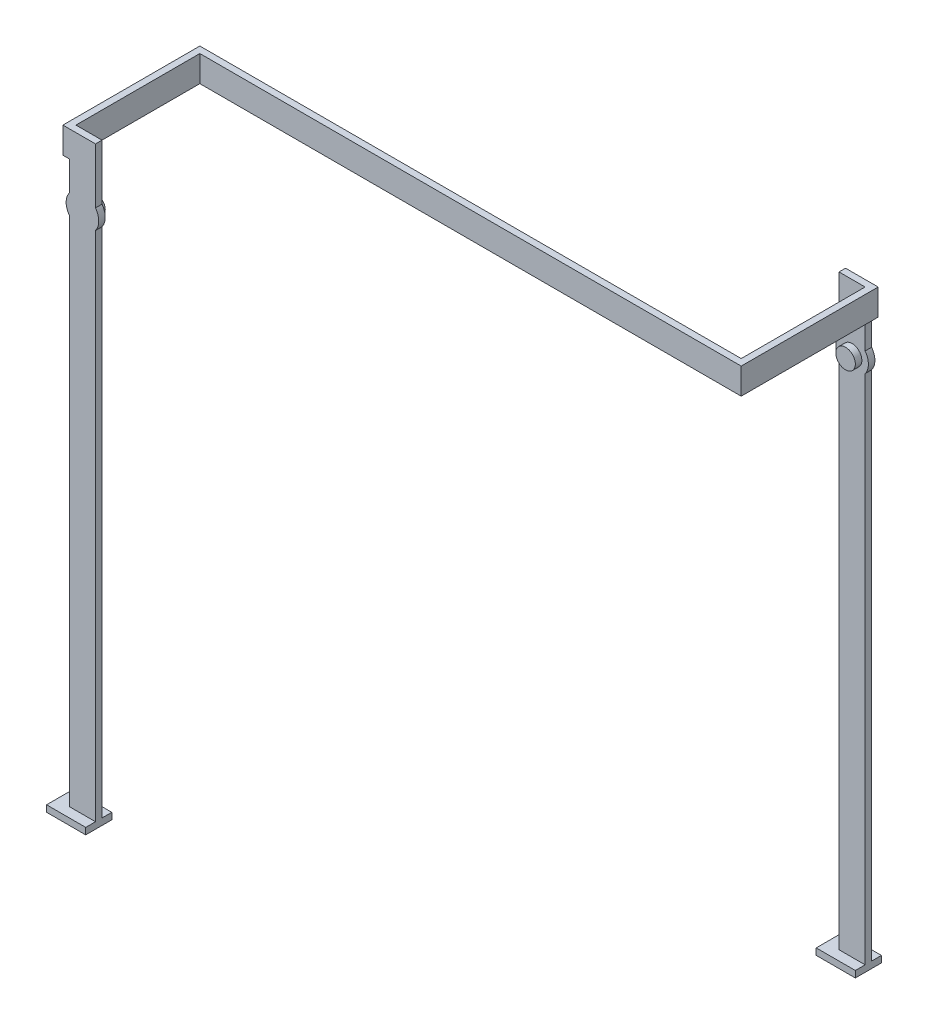
ISO-10303-21;
HEADER;
FILE_DESCRIPTION(('STEP AP214'),'2;1');
FILE_NAME('part.step','',(''),(''),'','','');
FILE_SCHEMA(('AUTOMOTIVE_DESIGN { 1 0 10303 214 1 1 1 1 }'));
ENDSEC;
DATA;
#1=APPLICATION_CONTEXT('core data for automotive mechanical design processes');
#2=APPLICATION_PROTOCOL_DEFINITION('international standard','automotive_design',2000,#1);
#3=PRODUCT_CONTEXT('',#1,'mechanical');
#4=PRODUCT('Part','Part','',(#3));
#5=PRODUCT_RELATED_PRODUCT_CATEGORY('part','',(#4));
#6=PRODUCT_DEFINITION_FORMATION('','',#4);
#7=PRODUCT_DEFINITION_CONTEXT('part definition',#1,'design');
#8=PRODUCT_DEFINITION('design','',#6,#7);
#9=PRODUCT_DEFINITION_SHAPE('','',#8);
#10=(LENGTH_UNIT() NAMED_UNIT(*) SI_UNIT(.MILLI.,.METRE.));
#11=(NAMED_UNIT(*) PLANE_ANGLE_UNIT() SI_UNIT($,.RADIAN.));
#12=(NAMED_UNIT(*) SI_UNIT($,.STERADIAN.) SOLID_ANGLE_UNIT());
#13=UNCERTAINTY_MEASURE_WITH_UNIT(LENGTH_MEASURE(1.E-05),#10,'distance_accuracy_value','');
#14=(GEOMETRIC_REPRESENTATION_CONTEXT(3) GLOBAL_UNCERTAINTY_ASSIGNED_CONTEXT((#13)) GLOBAL_UNIT_ASSIGNED_CONTEXT((#10,
#11,#12)) REPRESENTATION_CONTEXT('',''));
#15=CARTESIAN_POINT('',(0.,0.,0.));
#16=DIRECTION('',(0.,0.,1.));
#17=DIRECTION('',(1.,0.,0.));
#18=AXIS2_PLACEMENT_3D('',#15,#16,#17);
#19=CARTESIAN_POINT('',(25.7222833277684,47.5928129760568,-20.5));
#20=DIRECTION('',(-1.,0.,0.));
#21=DIRECTION('',(0.,0.,1.));
#22=AXIS2_PLACEMENT_3D('',#19,#20,#21);
#23=PLANE('',#22);
#24=DIRECTION('',(0.,0.,-1.));
#25=VECTOR('',#24,1.);
#26=CARTESIAN_POINT('',(25.7222833277684,47.5928129760568,-20.5));
#27=LINE('',#26,#25);
#28=CARTESIAN_POINT('',(25.7222833277684,47.5928129760568,-0.499999999999997));
#29=VERTEX_POINT('',#28);
#30=CARTESIAN_POINT('',(25.7222833277684,47.5928129760568,-19.5));
#31=VERTEX_POINT('',#30);
#32=EDGE_CURVE('E414',#29,#31,#27,.T.);
#33=ORIENTED_EDGE('',*,*,#32,.F.);
#34=DIRECTION('',(0.,1.,0.));
#35=VECTOR('',#34,1.);
#36=CARTESIAN_POINT('',(25.7222833277684,51.5928129760568,-0.5));
#37=LINE('',#36,#35);
#38=CARTESIAN_POINT('',(25.7222833277684,51.5928129760568,-0.5));
#39=VERTEX_POINT('',#38);
#40=EDGE_CURVE('E49',#29,#39,#37,.T.);
#41=ORIENTED_EDGE('',*,*,#40,.T.);
#42=DIRECTION('',(0.,0.,1.));
#43=VECTOR('',#42,1.);
#44=CARTESIAN_POINT('',(25.7222833277684,51.5928129760578,-20.5));
#45=LINE('',#44,#43);
#46=CARTESIAN_POINT('',(25.7222833277684,51.5928129760578,-19.5));
#47=VERTEX_POINT('',#46);
#48=EDGE_CURVE('E409',#47,#39,#45,.T.);
#49=ORIENTED_EDGE('',*,*,#48,.F.);
#50=DIRECTION('',(0.,-1.,0.));
#51=VECTOR('',#50,1.);
#52=CARTESIAN_POINT('',(25.7222833277684,51.5928129760579,-19.5));
#53=LINE('',#52,#51);
#54=EDGE_CURVE('E327',#47,#31,#53,.T.);
#55=ORIENTED_EDGE('',*,*,#54,.T.);
#56=EDGE_LOOP('',(#33,#41,#49,#55));
#57=FACE_BOUND('',#56,.T.);
#58=ADVANCED_FACE('F31',(#57),#23,.T.);
#59=CARTESIAN_POINT('',(25.7222833277684,51.5928129760579,-20.5));
#60=DIRECTION('',(-1.,0.,0.));
#61=DIRECTION('',(0.,-1.,0.));
#62=AXIS2_PLACEMENT_3D('',#59,#60,#61);
#63=PLANE('',#62);
#64=CARTESIAN_POINT('',(25.7222833277684,47.5928129760568,-20.5));
#65=VERTEX_POINT('',#64);
#66=EDGE_CURVE('E422',#31,#65,#27,.T.);
#67=ORIENTED_EDGE('',*,*,#66,.F.);
#68=CARTESIAN_POINT('',(25.7222833277684,43.0928129760574,-19.5));
#69=VERTEX_POINT('',#68);
#70=EDGE_CURVE('E333',#31,#69,#53,.T.);
#71=ORIENTED_EDGE('',*,*,#70,.T.);
#72=DIRECTION('',(0.,0.,1.));
#73=VECTOR('',#72,1.);
#74=CARTESIAN_POINT('',(25.7222833277684,43.0928129760574,-20.5));
#75=LINE('',#74,#73);
#76=CARTESIAN_POINT('',(25.7222833277684,43.0928129760574,-20.5));
#77=VERTEX_POINT('',#76);
#78=EDGE_CURVE('E311',#77,#69,#75,.T.);
#79=ORIENTED_EDGE('',*,*,#78,.F.);
#80=DIRECTION('',(0.,-1.,0.));
#81=VECTOR('',#80,1.);
#82=CARTESIAN_POINT('',(25.7222833277684,51.5928129760579,-20.5));
#83=LINE('',#82,#81);
#84=EDGE_CURVE('E313',#65,#77,#83,.T.);
#85=ORIENTED_EDGE('',*,*,#84,.F.);
#86=EDGE_LOOP('',(#67,#71,#79,#85));
#87=FACE_BOUND('',#86,.T.);
#88=ADVANCED_FACE('F455',(#87),#63,.F.);
#89=CARTESIAN_POINT('',(23.7222833277682,41.5928129760579,-19.5));
#90=DIRECTION('',(0.,0.,-1.));
#91=DIRECTION('',(0.,1.,0.));
#92=AXIS2_PLACEMENT_3D('',#89,#90,#91);
#93=PLANE('',#92);
#94=DIRECTION('',(-1.,0.,0.));
#95=VECTOR('',#94,1.);
#96=CARTESIAN_POINT('',(25.7222833277684,-38.4071870239421,-19.5));
#97=LINE('',#96,#95);
#98=CARTESIAN_POINT('',(25.7222833277684,-38.4071870239431,-19.5));
#99=VERTEX_POINT('',#98);
#100=CARTESIAN_POINT('',(21.7222833277684,-38.4071870239421,-19.5));
#101=VERTEX_POINT('',#100);
#102=EDGE_CURVE('E35',#99,#101,#97,.T.);
#103=ORIENTED_EDGE('',*,*,#102,.F.);
#104=DIRECTION('',(0.,-1.,0.));
#105=VECTOR('',#104,1.);
#106=CARTESIAN_POINT('',(25.7222833277684,40.0928129760584,-19.5));
#107=LINE('',#106,#105);
#108=CARTESIAN_POINT('',(25.7222833277684,40.0928129760584,-19.5));
#109=VERTEX_POINT('',#108);
#110=EDGE_CURVE('E321',#109,#99,#107,.T.);
#111=ORIENTED_EDGE('',*,*,#110,.F.);
#112=CARTESIAN_POINT('',(23.7222833277682,41.5928129760579,-19.5));
#113=DIRECTION('',(0.,0.,-1.));
#114=DIRECTION('',(0.,1.,0.));
#115=AXIS2_PLACEMENT_3D('',#112,#113,#114);
#116=CIRCLE('',#115,2.49999999999992);
#117=EDGE_CURVE('E322',#69,#109,#116,.T.);
#118=ORIENTED_EDGE('',*,*,#117,.F.);
#119=ORIENTED_EDGE('',*,*,#70,.F.);
#120=ORIENTED_EDGE('',*,*,#54,.F.);
#121=DIRECTION('',(1.,0.,0.));
#122=VECTOR('',#121,1.);
#123=CARTESIAN_POINT('',(25.7222833277684,51.5928129760579,-19.5));
#124=LINE('',#123,#122);
#125=CARTESIAN_POINT('',(21.7222833277684,51.5928129760579,-19.5));
#126=VERTEX_POINT('',#125);
#127=EDGE_CURVE('E446',#126,#47,#124,.T.);
#128=ORIENTED_EDGE('',*,*,#127,.F.);
#129=DIRECTION('',(0.,1.,0.));
#130=VECTOR('',#129,1.);
#131=CARTESIAN_POINT('',(21.7222833277684,51.5928129760579,-19.5));
#132=LINE('',#131,#130);
#133=CARTESIAN_POINT('',(21.7222833277684,43.0928129760581,-19.5));
#134=VERTEX_POINT('',#133);
#135=EDGE_CURVE('E445',#134,#126,#132,.T.);
#136=ORIENTED_EDGE('',*,*,#135,.F.);
#137=CARTESIAN_POINT('',(23.7222833277682,41.5928129760579,-19.5));
#138=DIRECTION('',(0.,0.,-1.));
#139=DIRECTION('',(0.,1.,0.));
#140=AXIS2_PLACEMENT_3D('',#137,#138,#139);
#141=CIRCLE('',#140,2.49999999999992);
#142=CARTESIAN_POINT('',(21.7222833277684,40.0928129760577,-19.5));
#143=VERTEX_POINT('',#142);
#144=EDGE_CURVE('E443',#143,#134,#141,.T.);
#145=ORIENTED_EDGE('',*,*,#144,.F.);
#146=DIRECTION('',(0.,1.,0.));
#147=VECTOR('',#146,1.);
#148=CARTESIAN_POINT('',(21.7222833277684,40.0928129760577,-19.5));
#149=LINE('',#148,#147);
#150=EDGE_CURVE('E441',#101,#143,#149,.T.);
#151=ORIENTED_EDGE('',*,*,#150,.F.);
#152=EDGE_LOOP('',(#103,#111,#118,#119,#120,#128,#136,#145,#151));
#153=FACE_BOUND('',#152,.T.);
#154=CARTESIAN_POINT('',(23.7222833277682,41.5928129760579,-19.5));
#155=DIRECTION('',(0.,0.,-1.));
#156=DIRECTION('',(0.,1.,0.));
#157=AXIS2_PLACEMENT_3D('',#154,#155,#156);
#158=CIRCLE('',#157,1.50000000000009);
#159=CARTESIAN_POINT('',(23.7222833277682,43.092812976058,-19.5));
#160=VERTEX_POINT('',#159);
#161=EDGE_CURVE('E11',#160,#160,#158,.F.);
#162=ORIENTED_EDGE('',*,*,#161,.F.);
#163=EDGE_LOOP('',(#162));
#164=FACE_BOUND('',#163,.T.);
#165=ADVANCED_FACE('F459',(#153,#164),#93,.F.);
#166=CARTESIAN_POINT('',(21.7222833277684,40.0928129760577,-20.5));
#167=DIRECTION('',(1.,0.,0.));
#168=DIRECTION('',(0.,1.,0.));
#169=AXIS2_PLACEMENT_3D('',#166,#167,#168);
#170=PLANE('',#169);
#171=ORIENTED_EDGE('',*,*,#150,.T.);
#172=DIRECTION('',(0.,0.,1.));
#173=VECTOR('',#172,1.);
#174=CARTESIAN_POINT('',(21.7222833277684,40.0928129760577,-20.5));
#175=LINE('',#174,#173);
#176=CARTESIAN_POINT('',(21.7222833277684,40.0928129760577,-20.5));
#177=VERTEX_POINT('',#176);
#178=EDGE_CURVE('E344',#177,#143,#175,.T.);
#179=ORIENTED_EDGE('',*,*,#178,.F.);
#180=DIRECTION('',(0.,1.,0.));
#181=VECTOR('',#180,1.);
#182=CARTESIAN_POINT('',(21.7222833277684,40.0928129760577,-20.5));
#183=LINE('',#182,#181);
#184=CARTESIAN_POINT('',(21.7222833277684,-38.4071870239421,-20.5));
#185=VERTEX_POINT('',#184);
#186=EDGE_CURVE('E326',#185,#177,#183,.T.);
#187=ORIENTED_EDGE('',*,*,#186,.F.);
#188=DIRECTION('',(0.,0.,1.));
#189=VECTOR('',#188,1.);
#190=CARTESIAN_POINT('',(21.7222833277684,-38.4071870239421,-20.5));
#191=LINE('',#190,#189);
#192=EDGE_CURVE('E41',#185,#101,#191,.T.);
#193=ORIENTED_EDGE('',*,*,#192,.T.);
#194=EDGE_LOOP('',(#171,#179,#187,#193));
#195=FACE_BOUND('',#194,.T.);
#196=ADVANCED_FACE('F33',(#195),#170,.F.);
#197=CARTESIAN_POINT('',(23.7222833277682,41.5928129760579,-20.5));
#198=DIRECTION('',(0.,0.,1.));
#199=DIRECTION('',(0.,-1.,0.));
#200=AXIS2_PLACEMENT_3D('',#197,#198,#199);
#201=CYLINDRICAL_SURFACE('',#200,2.49999999999992);
#202=ORIENTED_EDGE('',*,*,#144,.T.);
#203=DIRECTION('',(0.,0.,1.));
#204=VECTOR('',#203,1.);
#205=CARTESIAN_POINT('',(21.7222833277684,43.0928129760581,-20.5));
#206=LINE('',#205,#204);
#207=CARTESIAN_POINT('',(21.7222833277684,43.0928129760581,-20.5));
#208=VERTEX_POINT('',#207);
#209=EDGE_CURVE('E341',#208,#134,#206,.T.);
#210=ORIENTED_EDGE('',*,*,#209,.F.);
#211=CARTESIAN_POINT('',(23.7222833277682,41.5928129760579,-20.5));
#212=DIRECTION('',(0.,0.,-1.));
#213=DIRECTION('',(0.,1.,0.));
#214=AXIS2_PLACEMENT_3D('',#211,#212,#213);
#215=CIRCLE('',#214,2.49999999999992);
#216=EDGE_CURVE('E433',#177,#208,#215,.T.);
#217=ORIENTED_EDGE('',*,*,#216,.F.);
#218=ORIENTED_EDGE('',*,*,#178,.T.);
#219=EDGE_LOOP('',(#202,#210,#217,#218));
#220=FACE_BOUND('',#219,.T.);
#221=ADVANCED_FACE('F514',(#220),#201,.T.);
#222=CARTESIAN_POINT('',(21.7222833277684,51.5928129760579,-20.5));
#223=DIRECTION('',(1.,0.,0.));
#224=DIRECTION('',(0.,0.,-1.));
#225=AXIS2_PLACEMENT_3D('',#222,#223,#224);
#226=PLANE('',#225);
#227=ORIENTED_EDGE('',*,*,#135,.T.);
#228=DIRECTION('',(0.,0.,1.));
#229=VECTOR('',#228,1.);
#230=CARTESIAN_POINT('',(21.7222833277684,51.5928129760579,-20.5));
#231=LINE('',#230,#229);
#232=CARTESIAN_POINT('',(21.7222833277684,51.5928129760579,-20.5));
#233=VERTEX_POINT('',#232);
#234=EDGE_CURVE('E338',#233,#126,#231,.T.);
#235=ORIENTED_EDGE('',*,*,#234,.F.);
#236=DIRECTION('',(0.,1.,0.));
#237=VECTOR('',#236,1.);
#238=CARTESIAN_POINT('',(21.7222833277684,51.5928129760579,-20.5));
#239=LINE('',#238,#237);
#240=EDGE_CURVE('E435',#208,#233,#239,.T.);
#241=ORIENTED_EDGE('',*,*,#240,.F.);
#242=ORIENTED_EDGE('',*,*,#209,.T.);
#243=EDGE_LOOP('',(#227,#235,#241,#242));
#244=FACE_BOUND('',#243,.T.);
#245=ADVANCED_FACE('F512',(#244),#226,.F.);
#246=CARTESIAN_POINT('',(25.7222833277684,51.5928129760579,-20.5));
#247=DIRECTION('',(0.,-1.,0.));
#248=DIRECTION('',(0.,0.,-1.));
#249=AXIS2_PLACEMENT_3D('',#246,#247,#248);
#250=PLANE('',#249);
#251=ORIENTED_EDGE('',*,*,#127,.T.);
#252=ORIENTED_EDGE('',*,*,#48,.T.);
#253=DIRECTION('',(1.,0.,0.));
#254=VECTOR('',#253,1.);
#255=CARTESIAN_POINT('',(-57.2777166722347,51.5928129760568,-0.5));
#256=LINE('',#255,#254);
#257=CARTESIAN_POINT('',(-57.2777166722347,51.5928129760568,-0.5));
#258=VERTEX_POINT('',#257);
#259=EDGE_CURVE('E530',#258,#39,#256,.T.);
#260=ORIENTED_EDGE('',*,*,#259,.F.);
#261=DIRECTION('',(0.,0.,-1.));
#262=VECTOR('',#261,1.);
#263=CARTESIAN_POINT('',(-57.2777166722347,51.5928129760568,20.5000000000002));
#264=LINE('',#263,#262);
#265=CARTESIAN_POINT('',(-57.2777166722347,51.5928129760568,20.5000000000002));
#266=VERTEX_POINT('',#265);
#267=EDGE_CURVE('E533',#266,#258,#264,.T.);
#268=ORIENTED_EDGE('',*,*,#267,.F.);
#269=DIRECTION('',(-1.,0.,0.));
#270=VECTOR('',#269,1.);
#271=CARTESIAN_POINT('',(-56.277716672231,51.5928129760568,20.5000000000002));
#272=LINE('',#271,#270);
#273=CARTESIAN_POINT('',(-52.277716672231,51.5928129760568,20.5000000000002));
#274=VERTEX_POINT('',#273);
#275=EDGE_CURVE('E563',#274,#266,#272,.T.);
#276=ORIENTED_EDGE('',*,*,#275,.F.);
#277=DIRECTION('',(0.,0.,-1.));
#278=VECTOR('',#277,1.);
#279=CARTESIAN_POINT('',(-52.277716672231,51.5928129760568,20.5000000000002));
#280=LINE('',#279,#278);
#281=CARTESIAN_POINT('',(-52.277716672231,51.5928129760568,19.5000000000002));
#282=VERTEX_POINT('',#281);
#283=EDGE_CURVE('E397',#274,#282,#280,.T.);
#284=ORIENTED_EDGE('',*,*,#283,.T.);
#285=DIRECTION('',(-1.,0.,0.));
#286=VECTOR('',#285,1.);
#287=CARTESIAN_POINT('',(-56.277716672231,51.5928129760568,19.5000000000002));
#288=LINE('',#287,#286);
#289=CARTESIAN_POINT('',(-56.2777166722347,51.5928129760568,19.5000000000002));
#290=VERTEX_POINT('',#289);
#291=EDGE_CURVE('E377',#282,#290,#288,.T.);
#292=ORIENTED_EDGE('',*,*,#291,.T.);
#293=DIRECTION('',(0.,0.,-1.));
#294=VECTOR('',#293,1.);
#295=CARTESIAN_POINT('',(-56.2777166722347,51.5928129760568,20.5000000000002));
#296=LINE('',#295,#294);
#297=CARTESIAN_POINT('',(-56.277716672231,51.5928129760568,0.5));
#298=VERTEX_POINT('',#297);
#299=EDGE_CURVE('E549',#290,#298,#296,.T.);
#300=ORIENTED_EDGE('',*,*,#299,.T.);
#301=DIRECTION('',(-1.,0.,0.));
#302=VECTOR('',#301,1.);
#303=CARTESIAN_POINT('',(26.7222833277684,51.5928129760578,0.500000000000013));
#304=LINE('',#303,#302);
#305=CARTESIAN_POINT('',(26.7222833277684,51.5928129760578,0.500000000000013));
#306=VERTEX_POINT('',#305);
#307=EDGE_CURVE('E427',#306,#298,#304,.T.);
#308=ORIENTED_EDGE('',*,*,#307,.F.);
#309=DIRECTION('',(0.,0.,1.));
#310=VECTOR('',#309,1.);
#311=CARTESIAN_POINT('',(26.7222833277684,51.5928129760578,-20.5));
#312=LINE('',#311,#310);
#313=CARTESIAN_POINT('',(26.7222833277684,51.5928129760578,-20.5));
#314=VERTEX_POINT('',#313);
#315=EDGE_CURVE('E413',#314,#306,#312,.T.);
#316=ORIENTED_EDGE('',*,*,#315,.F.);
#317=DIRECTION('',(1.,0.,0.));
#318=VECTOR('',#317,1.);
#319=CARTESIAN_POINT('',(25.7222833277684,51.5928129760579,-20.5));
#320=LINE('',#319,#318);
#321=EDGE_CURVE('E437',#233,#314,#320,.T.);
#322=ORIENTED_EDGE('',*,*,#321,.F.);
#323=ORIENTED_EDGE('',*,*,#234,.T.);
#324=EDGE_LOOP('',(#251,#252,#260,#268,#276,#284,#292,#300,#308,#316,#322,#323));
#325=FACE_BOUND('',#324,.T.);
#326=ADVANCED_FACE('F508',(#325),#250,.F.);
#327=CARTESIAN_POINT('',(23.7222833277682,41.5928129760579,-20.5));
#328=DIRECTION('',(0.,0.,1.));
#329=DIRECTION('',(0.,-1.,0.));
#330=AXIS2_PLACEMENT_3D('',#327,#328,#329);
#331=CYLINDRICAL_SURFACE('',#330,2.49999999999992);
#332=ORIENTED_EDGE('',*,*,#117,.T.);
#333=DIRECTION('',(0.,0.,1.));
#334=VECTOR('',#333,1.);
#335=CARTESIAN_POINT('',(25.7222833277684,40.0928129760584,-20.5));
#336=LINE('',#335,#334);
#337=CARTESIAN_POINT('',(25.7222833277684,40.0928129760584,-20.5));
#338=VERTEX_POINT('',#337);
#339=EDGE_CURVE('E309',#338,#109,#336,.T.);
#340=ORIENTED_EDGE('',*,*,#339,.F.);
#341=CARTESIAN_POINT('',(23.7222833277682,41.5928129760579,-20.5));
#342=DIRECTION('',(0.,0.,-1.));
#343=DIRECTION('',(0.,1.,0.));
#344=AXIS2_PLACEMENT_3D('',#341,#342,#343);
#345=CIRCLE('',#344,2.49999999999992);
#346=EDGE_CURVE('E307',#77,#338,#345,.T.);
#347=ORIENTED_EDGE('',*,*,#346,.F.);
#348=ORIENTED_EDGE('',*,*,#78,.T.);
#349=EDGE_LOOP('',(#332,#340,#347,#348));
#350=FACE_BOUND('',#349,.T.);
#351=ADVANCED_FACE('F458',(#350),#331,.T.);
#352=CARTESIAN_POINT('',(25.7222833277684,40.0928129760584,-20.5));
#353=DIRECTION('',(-1.,0.,0.));
#354=DIRECTION('',(0.,-1.,0.));
#355=AXIS2_PLACEMENT_3D('',#352,#353,#354);
#356=PLANE('',#355);
#357=ORIENTED_EDGE('',*,*,#110,.T.);
#358=DIRECTION('',(0.,0.,1.));
#359=VECTOR('',#358,1.);
#360=CARTESIAN_POINT('',(25.7222833277684,-38.4071870239431,-22.));
#361=LINE('',#360,#359);
#362=CARTESIAN_POINT('',(25.7222833277684,-38.4071870239431,-18.));
#363=VERTEX_POINT('',#362);
#364=EDGE_CURVE('E262',#99,#363,#361,.T.);
#365=ORIENTED_EDGE('',*,*,#364,.T.);
#366=DIRECTION('',(0.,1.,0.));
#367=VECTOR('',#366,1.);
#368=CARTESIAN_POINT('',(25.7222833277684,-39.4071870239431,-18.));
#369=LINE('',#368,#367);
#370=CARTESIAN_POINT('',(25.7222833277684,-39.4071870239431,-18.));
#371=VERTEX_POINT('',#370);
#372=EDGE_CURVE('E243',#371,#363,#369,.T.);
#373=ORIENTED_EDGE('',*,*,#372,.F.);
#374=DIRECTION('',(0.,0.,1.));
#375=VECTOR('',#374,1.);
#376=CARTESIAN_POINT('',(25.7222833277684,-39.4071870239431,-22.));
#377=LINE('',#376,#375);
#378=CARTESIAN_POINT('',(25.7222833277684,-39.4071870239431,-22.));
#379=VERTEX_POINT('',#378);
#380=EDGE_CURVE('E249',#379,#371,#377,.T.);
#381=ORIENTED_EDGE('',*,*,#380,.F.);
#382=DIRECTION('',(0.,1.,0.));
#383=VECTOR('',#382,1.);
#384=CARTESIAN_POINT('',(25.7222833277684,-39.4071870239431,-22.));
#385=LINE('',#384,#383);
#386=CARTESIAN_POINT('',(25.7222833277684,-38.4071870239431,-22.));
#387=VERTEX_POINT('',#386);
#388=EDGE_CURVE('E288',#379,#387,#385,.T.);
#389=ORIENTED_EDGE('',*,*,#388,.T.);
#390=CARTESIAN_POINT('',(25.7222833277684,-38.4071870239431,-20.5));
#391=VERTEX_POINT('',#390);
#392=EDGE_CURVE('E273',#387,#391,#361,.T.);
#393=ORIENTED_EDGE('',*,*,#392,.T.);
#394=DIRECTION('',(0.,-1.,0.));
#395=VECTOR('',#394,1.);
#396=CARTESIAN_POINT('',(25.7222833277684,40.0928129760584,-20.5));
#397=LINE('',#396,#395);
#398=EDGE_CURVE('E304',#338,#391,#397,.T.);
#399=ORIENTED_EDGE('',*,*,#398,.F.);
#400=ORIENTED_EDGE('',*,*,#339,.T.);
#401=EDGE_LOOP('',(#357,#365,#373,#381,#389,#393,#399,#400));
#402=FACE_BOUND('',#401,.T.);
#403=ADVANCED_FACE('F261',(#402),#356,.F.);
#404=CARTESIAN_POINT('',(23.7222833277682,41.5928129760579,-20.5));
#405=DIRECTION('',(0.,0.,-1.));
#406=DIRECTION('',(0.,1.,0.));
#407=AXIS2_PLACEMENT_3D('',#404,#405,#406);
#408=PLANE('',#407);
#409=DIRECTION('',(-1.,0.,0.));
#410=VECTOR('',#409,1.);
#411=CARTESIAN_POINT('',(25.7222833277684,-38.4071870239421,-20.5));
#412=LINE('',#411,#410);
#413=EDGE_CURVE('E300',#391,#185,#412,.T.);
#414=ORIENTED_EDGE('',*,*,#413,.T.);
#415=ORIENTED_EDGE('',*,*,#186,.T.);
#416=ORIENTED_EDGE('',*,*,#216,.T.);
#417=ORIENTED_EDGE('',*,*,#240,.T.);
#418=ORIENTED_EDGE('',*,*,#321,.T.);
#419=DIRECTION('',(0.,1.,0.));
#420=VECTOR('',#419,1.);
#421=CARTESIAN_POINT('',(26.7222833277684,51.5928129760578,-20.5));
#422=LINE('',#421,#420);
#423=CARTESIAN_POINT('',(26.7222833277684,47.5928129760568,-20.5));
#424=VERTEX_POINT('',#423);
#425=EDGE_CURVE('E410',#424,#314,#422,.T.);
#426=ORIENTED_EDGE('',*,*,#425,.F.);
#427=DIRECTION('',(-1.,0.,0.));
#428=VECTOR('',#427,1.);
#429=CARTESIAN_POINT('',(26.7222833277684,47.5928129760568,-20.5));
#430=LINE('',#429,#428);
#431=EDGE_CURVE('E57',#424,#65,#430,.T.);
#432=ORIENTED_EDGE('',*,*,#431,.T.);
#433=ORIENTED_EDGE('',*,*,#84,.T.);
#434=ORIENTED_EDGE('',*,*,#346,.T.);
#435=ORIENTED_EDGE('',*,*,#398,.T.);
#436=EDGE_LOOP('',(#414,#415,#416,#417,#418,#426,#432,#433,#434,#435));
#437=FACE_BOUND('',#436,.T.);
#438=ADVANCED_FACE('F305',(#437),#408,.T.);
#439=CARTESIAN_POINT('',(23.7222833277682,41.5928129760579,-18.5));
#440=DIRECTION('',(0.,0.,-1.));
#441=DIRECTION('',(-1.,0.,0.));
#442=AXIS2_PLACEMENT_3D('',#439,#440,#441);
#443=CYLINDRICAL_SURFACE('',#442,1.50000000000009);
#444=CARTESIAN_POINT('',(23.7222833277682,41.5928129760579,-18.5));
#445=DIRECTION('',(0.,0.,1.));
#446=DIRECTION('',(1.,0.,0.));
#447=AXIS2_PLACEMENT_3D('',#444,#445,#446);
#448=CIRCLE('',#447,1.50000000000009);
#449=CARTESIAN_POINT('',(25.2222833277683,41.5928129760579,-18.5));
#450=VERTEX_POINT('',#449);
#451=EDGE_CURVE('E429',#450,#450,#448,.T.);
#452=ORIENTED_EDGE('',*,*,#451,.F.);
#453=EDGE_LOOP('',(#452));
#454=FACE_BOUND('',#453,.T.);
#455=ORIENTED_EDGE('',*,*,#161,.T.);
#456=EDGE_LOOP('',(#455));
#457=FACE_BOUND('',#456,.T.);
#458=ADVANCED_FACE('F496',(#454,#457),#443,.T.);
#459=CARTESIAN_POINT('',(23.7222833277682,41.5928129760579,-18.5));
#460=DIRECTION('',(0.,0.,1.));
#461=DIRECTION('',(1.,0.,0.));
#462=AXIS2_PLACEMENT_3D('',#459,#460,#461);
#463=PLANE('',#462);
#464=ORIENTED_EDGE('',*,*,#451,.T.);
#465=EDGE_LOOP('',(#464));
#466=FACE_BOUND('',#465,.T.);
#467=ADVANCED_FACE('F492',(#466),#463,.T.);
#468=CARTESIAN_POINT('',(26.7222833277684,51.5928129760578,0.500000000000013));
#469=DIRECTION('',(0.,0.,-1.));
#470=DIRECTION('',(0.,1.,0.));
#471=AXIS2_PLACEMENT_3D('',#468,#469,#470);
#472=PLANE('',#471);
#473=ORIENTED_EDGE('',*,*,#307,.T.);
#474=DIRECTION('',(0.,-1.,0.));
#475=VECTOR('',#474,1.);
#476=CARTESIAN_POINT('',(-56.277716672231,51.5928129760568,0.5));
#477=LINE('',#476,#475);
#478=CARTESIAN_POINT('',(-56.2777166722347,47.5928129760568,0.499999999999997));
#479=VERTEX_POINT('',#478);
#480=EDGE_CURVE('E553',#298,#479,#477,.T.);
#481=ORIENTED_EDGE('',*,*,#480,.T.);
#482=DIRECTION('',(-1.,0.,0.));
#483=VECTOR('',#482,1.);
#484=CARTESIAN_POINT('',(26.7222833277684,47.5928129760568,0.5));
#485=LINE('',#484,#483);
#486=CARTESIAN_POINT('',(26.7222833277684,47.5928129760568,0.5));
#487=VERTEX_POINT('',#486);
#488=EDGE_CURVE('E425',#487,#479,#485,.T.);
#489=ORIENTED_EDGE('',*,*,#488,.F.);
#490=DIRECTION('',(0.,-1.,0.));
#491=VECTOR('',#490,1.);
#492=CARTESIAN_POINT('',(26.7222833277684,51.5928129760578,0.500000000000013));
#493=LINE('',#492,#491);
#494=EDGE_CURVE('E416',#306,#487,#493,.T.);
#495=ORIENTED_EDGE('',*,*,#494,.F.);
#496=EDGE_LOOP('',(#473,#481,#489,#495));
#497=FACE_BOUND('',#496,.T.);
#498=ADVANCED_FACE('F488',(#497),#472,.F.);
#499=CARTESIAN_POINT('',(26.7222833277684,47.5928129760568,-20.5));
#500=DIRECTION('',(0.,1.,0.));
#501=DIRECTION('',(0.,0.,1.));
#502=AXIS2_PLACEMENT_3D('',#499,#500,#501);
#503=PLANE('',#502);
#504=ORIENTED_EDGE('',*,*,#488,.T.);
#505=DIRECTION('',(0.,0.,1.));
#506=VECTOR('',#505,1.);
#507=CARTESIAN_POINT('',(-56.2777166722347,47.5928129760568,20.5000000000002));
#508=LINE('',#507,#506);
#509=CARTESIAN_POINT('',(-56.2777166722347,47.5928129760568,19.5000000000002));
#510=VERTEX_POINT('',#509);
#511=EDGE_CURVE('E554',#479,#510,#508,.T.);
#512=ORIENTED_EDGE('',*,*,#511,.T.);
#513=CARTESIAN_POINT('',(-56.2777166722313,47.5928129760568,20.5000000000002));
#514=VERTEX_POINT('',#513);
#515=EDGE_CURVE('E552',#510,#514,#508,.T.);
#516=ORIENTED_EDGE('',*,*,#515,.T.);
#517=DIRECTION('',(1.,0.,0.));
#518=VECTOR('',#517,1.);
#519=CARTESIAN_POINT('',(-57.2777166722347,47.5928129760568,20.5000000000002));
#520=LINE('',#519,#518);
#521=CARTESIAN_POINT('',(-57.2777166722347,47.5928129760568,20.5000000000002));
#522=VERTEX_POINT('',#521);
#523=EDGE_CURVE('E543',#522,#514,#520,.T.);
#524=ORIENTED_EDGE('',*,*,#523,.F.);
#525=DIRECTION('',(0.,0.,1.));
#526=VECTOR('',#525,1.);
#527=CARTESIAN_POINT('',(-57.2777166722347,47.5928129760568,20.5000000000002));
#528=LINE('',#527,#526);
#529=CARTESIAN_POINT('',(-57.2777166722347,47.5928129760568,-0.5));
#530=VERTEX_POINT('',#529);
#531=EDGE_CURVE('E541',#530,#522,#528,.T.);
#532=ORIENTED_EDGE('',*,*,#531,.F.);
#533=DIRECTION('',(1.,0.,0.));
#534=VECTOR('',#533,1.);
#535=CARTESIAN_POINT('',(-57.2777166722347,47.5928129760568,-0.5));
#536=LINE('',#535,#534);
#537=EDGE_CURVE('E535',#530,#29,#536,.T.);
#538=ORIENTED_EDGE('',*,*,#537,.T.);
#539=ORIENTED_EDGE('',*,*,#32,.T.);
#540=ORIENTED_EDGE('',*,*,#66,.T.);
#541=ORIENTED_EDGE('',*,*,#431,.F.);
#542=DIRECTION('',(0.,0.,-1.));
#543=VECTOR('',#542,1.);
#544=CARTESIAN_POINT('',(26.7222833277684,47.5928129760568,-20.5));
#545=LINE('',#544,#543);
#546=EDGE_CURVE('E418',#487,#424,#545,.T.);
#547=ORIENTED_EDGE('',*,*,#546,.F.);
#548=EDGE_LOOP('',(#504,#512,#516,#524,#532,#538,#539,#540,#541,#547));
#549=FACE_BOUND('',#548,.T.);
#550=ADVANCED_FACE('F485',(#549),#503,.F.);
#551=CARTESIAN_POINT('',(26.7222833277684,47.5928129760568,-20.5));
#552=DIRECTION('',(-1.,0.,0.));
#553=DIRECTION('',(0.,0.,1.));
#554=AXIS2_PLACEMENT_3D('',#551,#552,#553);
#555=PLANE('',#554);
#556=ORIENTED_EDGE('',*,*,#425,.T.);
#557=ORIENTED_EDGE('',*,*,#315,.T.);
#558=ORIENTED_EDGE('',*,*,#494,.T.);
#559=ORIENTED_EDGE('',*,*,#546,.T.);
#560=EDGE_LOOP('',(#556,#557,#558,#559));
#561=FACE_BOUND('',#560,.T.);
#562=ADVANCED_FACE('F483',(#561),#555,.F.);
#563=CARTESIAN_POINT('',(-56.277716672231,51.5928129760568,20.5000000000002));
#564=DIRECTION('',(1.,0.,0.));
#565=DIRECTION('',(0.,1.,0.));
#566=AXIS2_PLACEMENT_3D('',#563,#564,#565);
#567=PLANE('',#566);
#568=ORIENTED_EDGE('',*,*,#515,.F.);
#569=DIRECTION('',(0.,-1.,0.));
#570=VECTOR('',#569,1.);
#571=CARTESIAN_POINT('',(-56.277716672231,51.5928129760568,19.5000000000002));
#572=LINE('',#571,#570);
#573=CARTESIAN_POINT('',(-56.2777166722316,43.0928129760531,19.5000000000002));
#574=VERTEX_POINT('',#573);
#575=EDGE_CURVE('E380',#510,#574,#572,.T.);
#576=ORIENTED_EDGE('',*,*,#575,.T.);
#577=DIRECTION('',(0.,0.,-1.));
#578=VECTOR('',#577,1.);
#579=CARTESIAN_POINT('',(-56.2777166722316,43.0928129760531,20.5000000000002));
#580=LINE('',#579,#578);
#581=CARTESIAN_POINT('',(-56.2777166722316,43.0928129760531,20.5000000000002));
#582=VERTEX_POINT('',#581);
#583=EDGE_CURVE('E394',#582,#574,#580,.T.);
#584=ORIENTED_EDGE('',*,*,#583,.F.);
#585=DIRECTION('',(0.,-1.,0.));
#586=VECTOR('',#585,1.);
#587=CARTESIAN_POINT('',(-56.277716672231,51.5928129760568,20.5000000000002));
#588=LINE('',#587,#586);
#589=EDGE_CURVE('E565',#514,#582,#588,.T.);
#590=ORIENTED_EDGE('',*,*,#589,.F.);
#591=EDGE_LOOP('',(#568,#576,#584,#590));
#592=FACE_BOUND('',#591,.T.);
#593=ADVANCED_FACE('F637',(#592),#567,.F.);
#594=CARTESIAN_POINT('',(-54.2777166722332,41.5928129760568,19.5000000000002));
#595=DIRECTION('',(0.,0.,1.));
#596=DIRECTION('',(1.,0.,0.));
#597=AXIS2_PLACEMENT_3D('',#594,#595,#596);
#598=PLANE('',#597);
#599=DIRECTION('',(1.,0.,0.));
#600=VECTOR('',#599,1.);
#601=CARTESIAN_POINT('',(-56.277716672231,-38.4071870239432,19.5000000000002));
#602=LINE('',#601,#600);
#603=CARTESIAN_POINT('',(-56.277716672231,-38.4071870239432,19.5000000000002));
#604=VERTEX_POINT('',#603);
#605=CARTESIAN_POINT('',(-52.277716672231,-38.4071870239432,19.5000000000002));
#606=VERTEX_POINT('',#605);
#607=EDGE_CURVE('E363',#604,#606,#602,.T.);
#608=ORIENTED_EDGE('',*,*,#607,.F.);
#609=DIRECTION('',(0.,-1.,0.));
#610=VECTOR('',#609,1.);
#611=CARTESIAN_POINT('',(-56.277716672231,40.0928129760597,19.5000000000002));
#612=LINE('',#611,#610);
#613=CARTESIAN_POINT('',(-56.277716672231,40.0928129760597,19.5000000000002));
#614=VERTEX_POINT('',#613);
#615=EDGE_CURVE('E357',#614,#604,#612,.T.);
#616=ORIENTED_EDGE('',*,*,#615,.F.);
#617=CARTESIAN_POINT('',(-54.2777166722332,41.5928129760568,19.5000000000002));
#618=DIRECTION('',(0.,0.,1.));
#619=DIRECTION('',(1.,0.,0.));
#620=AXIS2_PLACEMENT_3D('',#617,#618,#619);
#621=CIRCLE('',#620,2.49999999999648);
#622=EDGE_CURVE('E384',#574,#614,#621,.T.);
#623=ORIENTED_EDGE('',*,*,#622,.F.);
#624=ORIENTED_EDGE('',*,*,#575,.F.);
#625=EDGE_CURVE('E381',#290,#510,#572,.T.);
#626=ORIENTED_EDGE('',*,*,#625,.F.);
#627=ORIENTED_EDGE('',*,*,#291,.F.);
#628=DIRECTION('',(0.,1.,0.));
#629=VECTOR('',#628,1.);
#630=CARTESIAN_POINT('',(-52.277716672231,51.5928129760568,19.5000000000002));
#631=LINE('',#630,#629);
#632=CARTESIAN_POINT('',(-52.2777166722309,43.092812976048,19.5000000000002));
#633=VERTEX_POINT('',#632);
#634=EDGE_CURVE('E375',#633,#282,#631,.T.);
#635=ORIENTED_EDGE('',*,*,#634,.F.);
#636=CARTESIAN_POINT('',(-54.2777166722332,41.5928129760568,19.5000000000002));
#637=DIRECTION('',(0.,0.,1.));
#638=DIRECTION('',(1.,0.,0.));
#639=AXIS2_PLACEMENT_3D('',#636,#637,#638);
#640=CIRCLE('',#639,2.49999999999656);
#641=CARTESIAN_POINT('',(-52.2777166722315,40.0928129760648,19.5000000000002));
#642=VERTEX_POINT('',#641);
#643=EDGE_CURVE('E362',#642,#633,#640,.T.);
#644=ORIENTED_EDGE('',*,*,#643,.F.);
#645=DIRECTION('',(0.,1.,0.));
#646=VECTOR('',#645,1.);
#647=CARTESIAN_POINT('',(-52.2777166722315,40.0928129760648,19.5000000000002));
#648=LINE('',#647,#646);
#649=EDGE_CURVE('E360',#606,#642,#648,.T.);
#650=ORIENTED_EDGE('',*,*,#649,.F.);
#651=EDGE_LOOP('',(#608,#616,#623,#624,#626,#627,#635,#644,#650));
#652=FACE_BOUND('',#651,.T.);
#653=CARTESIAN_POINT('',(-54.2777166722332,41.5928129760568,19.5000000000002));
#654=DIRECTION('',(0.,0.,1.));
#655=DIRECTION('',(1.,0.,0.));
#656=AXIS2_PLACEMENT_3D('',#653,#654,#655);
#657=CIRCLE('',#656,1.49999999999847);
#658=CARTESIAN_POINT('',(-52.7777166722347,41.5928129760568,19.5000000000002));
#659=VERTEX_POINT('',#658);
#660=EDGE_CURVE('E406',#659,#659,#657,.F.);
#661=ORIENTED_EDGE('',*,*,#660,.F.);
#662=EDGE_LOOP('',(#661));
#663=FACE_BOUND('',#662,.T.);
#664=ADVANCED_FACE('F625',(#652,#663),#598,.F.);
#665=CARTESIAN_POINT('',(-52.2777166722315,40.0928129760648,20.5000000000002));
#666=DIRECTION('',(-1.,0.,0.));
#667=DIRECTION('',(0.,-1.,0.));
#668=AXIS2_PLACEMENT_3D('',#665,#666,#667);
#669=PLANE('',#668);
#670=ORIENTED_EDGE('',*,*,#649,.T.);
#671=DIRECTION('',(0.,0.,-1.));
#672=VECTOR('',#671,1.);
#673=CARTESIAN_POINT('',(-52.2777166722315,40.0928129760648,20.5000000000002));
#674=LINE('',#673,#672);
#675=CARTESIAN_POINT('',(-52.2777166722315,40.0928129760648,20.5000000000002));
#676=VERTEX_POINT('',#675);
#677=EDGE_CURVE('E403',#676,#642,#674,.T.);
#678=ORIENTED_EDGE('',*,*,#677,.F.);
#679=DIRECTION('',(0.,1.,0.));
#680=VECTOR('',#679,1.);
#681=CARTESIAN_POINT('',(-52.2777166722315,40.0928129760648,20.5000000000002));
#682=LINE('',#681,#680);
#683=CARTESIAN_POINT('',(-52.277716672231,-38.4071870239432,20.5000000000002));
#684=VERTEX_POINT('',#683);
#685=EDGE_CURVE('E349',#684,#676,#682,.T.);
#686=ORIENTED_EDGE('',*,*,#685,.F.);
#687=DIRECTION('',(0.,0.,1.));
#688=VECTOR('',#687,1.);
#689=CARTESIAN_POINT('',(-52.277716672231,-38.4071870239431,22.0000000000002));
#690=LINE('',#689,#688);
#691=CARTESIAN_POINT('',(-52.277716672231,-38.4071870239431,22.0000000000002));
#692=VERTEX_POINT('',#691);
#693=EDGE_CURVE('E581',#684,#692,#690,.T.);
#694=ORIENTED_EDGE('',*,*,#693,.T.);
#695=DIRECTION('',(0.,1.,0.));
#696=VECTOR('',#695,1.);
#697=CARTESIAN_POINT('',(-52.277716672231,-39.4071870239431,22.0000000000002));
#698=LINE('',#697,#696);
#699=CARTESIAN_POINT('',(-52.277716672231,-39.4071870239431,22.0000000000002));
#700=VERTEX_POINT('',#699);
#701=EDGE_CURVE('E604',#700,#692,#698,.T.);
#702=ORIENTED_EDGE('',*,*,#701,.F.);
#703=DIRECTION('',(0.,0.,1.));
#704=VECTOR('',#703,1.);
#705=CARTESIAN_POINT('',(-52.277716672231,-39.4071870239431,22.0000000000002));
#706=LINE('',#705,#704);
#707=CARTESIAN_POINT('',(-52.277716672231,-39.4071870239431,18.0000000000002));
#708=VERTEX_POINT('',#707);
#709=EDGE_CURVE('E676',#708,#700,#706,.T.);
#710=ORIENTED_EDGE('',*,*,#709,.F.);
#711=DIRECTION('',(0.,1.,0.));
#712=VECTOR('',#711,1.);
#713=CARTESIAN_POINT('',(-52.277716672231,-39.4071870239431,18.0000000000002));
#714=LINE('',#713,#712);
#715=CARTESIAN_POINT('',(-52.277716672231,-38.4071870239431,18.0000000000002));
#716=VERTEX_POINT('',#715);
#717=EDGE_CURVE('E607',#708,#716,#714,.T.);
#718=ORIENTED_EDGE('',*,*,#717,.T.);
#719=EDGE_CURVE('E587',#716,#606,#690,.T.);
#720=ORIENTED_EDGE('',*,*,#719,.T.);
#721=EDGE_LOOP('',(#670,#678,#686,#694,#702,#710,#718,#720));
#722=FACE_BOUND('',#721,.T.);
#723=ADVANCED_FACE('F654',(#722),#669,.F.);
#724=CARTESIAN_POINT('',(-54.2777166722332,41.5928129760568,20.5000000000002));
#725=DIRECTION('',(0.,0.,-1.));
#726=DIRECTION('',(-1.,0.,0.));
#727=AXIS2_PLACEMENT_3D('',#724,#725,#726);
#728=CYLINDRICAL_SURFACE('',#727,2.49999999999656);
#729=ORIENTED_EDGE('',*,*,#643,.T.);
#730=DIRECTION('',(0.,0.,-1.));
#731=VECTOR('',#730,1.);
#732=CARTESIAN_POINT('',(-52.2777166722309,43.092812976048,20.5000000000002));
#733=LINE('',#732,#731);
#734=CARTESIAN_POINT('',(-52.2777166722309,43.092812976048,20.5000000000002));
#735=VERTEX_POINT('',#734);
#736=EDGE_CURVE('E400',#735,#633,#733,.T.);
#737=ORIENTED_EDGE('',*,*,#736,.F.);
#738=CARTESIAN_POINT('',(-54.2777166722332,41.5928129760568,20.5000000000002));
#739=DIRECTION('',(0.,0.,1.));
#740=DIRECTION('',(1.,0.,0.));
#741=AXIS2_PLACEMENT_3D('',#738,#739,#740);
#742=CIRCLE('',#741,2.49999999999656);
#743=EDGE_CURVE('E351',#676,#735,#742,.T.);
#744=ORIENTED_EDGE('',*,*,#743,.F.);
#745=ORIENTED_EDGE('',*,*,#677,.T.);
#746=EDGE_LOOP('',(#729,#737,#744,#745));
#747=FACE_BOUND('',#746,.T.);
#748=ADVANCED_FACE('F663',(#747),#728,.T.);
#749=CARTESIAN_POINT('',(-52.277716672231,51.5928129760568,20.5000000000002));
#750=DIRECTION('',(-1.,0.,0.));
#751=DIRECTION('',(0.,-1.,0.));
#752=AXIS2_PLACEMENT_3D('',#749,#750,#751);
#753=PLANE('',#752);
#754=ORIENTED_EDGE('',*,*,#634,.T.);
#755=ORIENTED_EDGE('',*,*,#283,.F.);
#756=DIRECTION('',(0.,1.,0.));
#757=VECTOR('',#756,1.);
#758=CARTESIAN_POINT('',(-52.277716672231,51.5928129760568,20.5000000000002));
#759=LINE('',#758,#757);
#760=EDGE_CURVE('E561',#735,#274,#759,.T.);
#761=ORIENTED_EDGE('',*,*,#760,.F.);
#762=ORIENTED_EDGE('',*,*,#736,.T.);
#763=EDGE_LOOP('',(#754,#755,#761,#762));
#764=FACE_BOUND('',#763,.T.);
#765=ADVANCED_FACE('F660',(#764),#753,.F.);
#766=CARTESIAN_POINT('',(-54.2777166722332,41.5928129760568,20.5000000000002));
#767=DIRECTION('',(0.,0.,-1.));
#768=DIRECTION('',(-1.,0.,0.));
#769=AXIS2_PLACEMENT_3D('',#766,#767,#768);
#770=CYLINDRICAL_SURFACE('',#769,2.49999999999648);
#771=ORIENTED_EDGE('',*,*,#622,.T.);
#772=DIRECTION('',(0.,0.,-1.));
#773=VECTOR('',#772,1.);
#774=CARTESIAN_POINT('',(-56.277716672231,40.0928129760597,20.5000000000002));
#775=LINE('',#774,#773);
#776=CARTESIAN_POINT('',(-56.277716672231,40.0928129760597,20.5000000000002));
#777=VERTEX_POINT('',#776);
#778=EDGE_CURVE('E391',#777,#614,#775,.T.);
#779=ORIENTED_EDGE('',*,*,#778,.F.);
#780=CARTESIAN_POINT('',(-54.2777166722332,41.5928129760568,20.5000000000002));
#781=DIRECTION('',(0.,0.,1.));
#782=DIRECTION('',(1.,0.,0.));
#783=AXIS2_PLACEMENT_3D('',#780,#781,#782);
#784=CIRCLE('',#783,2.49999999999648);
#785=EDGE_CURVE('E566',#582,#777,#784,.T.);
#786=ORIENTED_EDGE('',*,*,#785,.F.);
#787=ORIENTED_EDGE('',*,*,#583,.T.);
#788=EDGE_LOOP('',(#771,#779,#786,#787));
#789=FACE_BOUND('',#788,.T.);
#790=ADVANCED_FACE('F658',(#789),#770,.T.);
#791=CARTESIAN_POINT('',(-56.277716672231,40.0928129760597,20.5000000000002));
#792=DIRECTION('',(1.,0.,0.));
#793=DIRECTION('',(0.,1.,0.));
#794=AXIS2_PLACEMENT_3D('',#791,#792,#793);
#795=PLANE('',#794);
#796=ORIENTED_EDGE('',*,*,#615,.T.);
#797=DIRECTION('',(0.,0.,-1.));
#798=VECTOR('',#797,1.);
#799=CARTESIAN_POINT('',(-56.277716672231,-38.4071870239432,20.5000000000002));
#800=LINE('',#799,#798);
#801=CARTESIAN_POINT('',(-56.277716672231,-38.4071870239432,20.5000000000002));
#802=VERTEX_POINT('',#801);
#803=EDGE_CURVE('E388',#802,#604,#800,.T.);
#804=ORIENTED_EDGE('',*,*,#803,.F.);
#805=DIRECTION('',(0.,-1.,0.));
#806=VECTOR('',#805,1.);
#807=CARTESIAN_POINT('',(-56.277716672231,40.0928129760597,20.5000000000002));
#808=LINE('',#807,#806);
#809=EDGE_CURVE('E372',#777,#802,#808,.T.);
#810=ORIENTED_EDGE('',*,*,#809,.F.);
#811=ORIENTED_EDGE('',*,*,#778,.T.);
#812=EDGE_LOOP('',(#796,#804,#810,#811));
#813=FACE_BOUND('',#812,.T.);
#814=ADVANCED_FACE('F576',(#813),#795,.F.);
#815=CARTESIAN_POINT('',(-54.2777166722332,41.5928129760568,20.5000000000002));
#816=DIRECTION('',(0.,0.,1.));
#817=DIRECTION('',(1.,0.,0.));
#818=AXIS2_PLACEMENT_3D('',#815,#816,#817);
#819=PLANE('',#818);
#820=DIRECTION('',(1.,0.,0.));
#821=VECTOR('',#820,1.);
#822=CARTESIAN_POINT('',(-56.277716672231,-38.4071870239432,20.5000000000002));
#823=LINE('',#822,#821);
#824=EDGE_CURVE('E352',#802,#684,#823,.T.);
#825=ORIENTED_EDGE('',*,*,#824,.T.);
#826=ORIENTED_EDGE('',*,*,#685,.T.);
#827=ORIENTED_EDGE('',*,*,#743,.T.);
#828=ORIENTED_EDGE('',*,*,#760,.T.);
#829=ORIENTED_EDGE('',*,*,#275,.T.);
#830=DIRECTION('',(0.,1.,0.));
#831=VECTOR('',#830,1.);
#832=CARTESIAN_POINT('',(-57.2777166722347,51.5928129760568,20.5000000000002));
#833=LINE('',#832,#831);
#834=EDGE_CURVE('E545',#522,#266,#833,.T.);
#835=ORIENTED_EDGE('',*,*,#834,.F.);
#836=ORIENTED_EDGE('',*,*,#523,.T.);
#837=ORIENTED_EDGE('',*,*,#589,.T.);
#838=ORIENTED_EDGE('',*,*,#785,.T.);
#839=ORIENTED_EDGE('',*,*,#809,.T.);
#840=EDGE_LOOP('',(#825,#826,#827,#828,#829,#835,#836,#837,#838,#839));
#841=FACE_BOUND('',#840,.T.);
#842=ADVANCED_FACE('F572',(#841),#819,.T.);
#843=CARTESIAN_POINT('',(-54.2777166722332,41.5928129760568,18.5000000000002));
#844=DIRECTION('',(0.,0.,1.));
#845=DIRECTION('',(1.,0.,0.));
#846=AXIS2_PLACEMENT_3D('',#843,#844,#845);
#847=CYLINDRICAL_SURFACE('',#846,1.49999999999847);
#848=CARTESIAN_POINT('',(-54.2777166722332,41.5928129760568,18.5000000000002));
#849=DIRECTION('',(0.,0.,-1.));
#850=DIRECTION('',(-1.,0.,0.));
#851=AXIS2_PLACEMENT_3D('',#848,#849,#850);
#852=CIRCLE('',#851,1.49999999999847);
#853=CARTESIAN_POINT('',(-55.7777166722317,41.5928129760568,18.5000000000002));
#854=VERTEX_POINT('',#853);
#855=EDGE_CURVE('E368',#854,#854,#852,.T.);
#856=ORIENTED_EDGE('',*,*,#855,.F.);
#857=EDGE_LOOP('',(#856));
#858=FACE_BOUND('',#857,.T.);
#859=ORIENTED_EDGE('',*,*,#660,.T.);
#860=EDGE_LOOP('',(#859));
#861=FACE_BOUND('',#860,.T.);
#862=ADVANCED_FACE('F712',(#858,#861),#847,.T.);
#863=CARTESIAN_POINT('',(-54.2777166722332,41.5928129760568,18.5000000000002));
#864=DIRECTION('',(0.,0.,-1.));
#865=DIRECTION('',(-1.,0.,0.));
#866=AXIS2_PLACEMENT_3D('',#863,#864,#865);
#867=PLANE('',#866);
#868=ORIENTED_EDGE('',*,*,#855,.T.);
#869=EDGE_LOOP('',(#868));
#870=FACE_BOUND('',#869,.T.);
#871=ADVANCED_FACE('F707',(#870),#867,.T.);
#872=CARTESIAN_POINT('',(-56.2777166722347,47.5928129760568,20.5000000000002));
#873=DIRECTION('',(1.,0.,0.));
#874=DIRECTION('',(0.,0.,-1.));
#875=AXIS2_PLACEMENT_3D('',#872,#873,#874);
#876=PLANE('',#875);
#877=ORIENTED_EDGE('',*,*,#480,.F.);
#878=ORIENTED_EDGE('',*,*,#299,.F.);
#879=ORIENTED_EDGE('',*,*,#625,.T.);
#880=ORIENTED_EDGE('',*,*,#511,.F.);
#881=EDGE_LOOP('',(#877,#878,#879,#880));
#882=FACE_BOUND('',#881,.T.);
#883=ADVANCED_FACE('F634',(#882),#876,.T.);
#884=CARTESIAN_POINT('',(-57.2777166722347,51.5928129760568,-0.5));
#885=DIRECTION('',(0.,0.,1.));
#886=DIRECTION('',(0.,-1.,0.));
#887=AXIS2_PLACEMENT_3D('',#884,#885,#886);
#888=PLANE('',#887);
#889=ORIENTED_EDGE('',*,*,#259,.T.);
#890=ORIENTED_EDGE('',*,*,#40,.F.);
#891=ORIENTED_EDGE('',*,*,#537,.F.);
#892=DIRECTION('',(0.,-1.,0.));
#893=VECTOR('',#892,1.);
#894=CARTESIAN_POINT('',(-57.2777166722347,51.5928129760568,-0.5));
#895=LINE('',#894,#893);
#896=EDGE_CURVE('E537',#258,#530,#895,.T.);
#897=ORIENTED_EDGE('',*,*,#896,.F.);
#898=EDGE_LOOP('',(#889,#890,#891,#897));
#899=FACE_BOUND('',#898,.T.);
#900=ADVANCED_FACE('F538',(#899),#888,.F.);
#901=CARTESIAN_POINT('',(-57.2777166722347,47.5928129760568,20.5000000000002));
#902=DIRECTION('',(1.,0.,0.));
#903=DIRECTION('',(0.,0.,-1.));
#904=AXIS2_PLACEMENT_3D('',#901,#902,#903);
#905=PLANE('',#904);
#906=ORIENTED_EDGE('',*,*,#834,.T.);
#907=ORIENTED_EDGE('',*,*,#267,.T.);
#908=ORIENTED_EDGE('',*,*,#896,.T.);
#909=ORIENTED_EDGE('',*,*,#531,.T.);
#910=EDGE_LOOP('',(#906,#907,#908,#909));
#911=FACE_BOUND('',#910,.T.);
#912=ADVANCED_FACE('F615',(#911),#905,.F.);
#913=CARTESIAN_POINT('',(-58.277716672231,-38.4071870239431,18.0000000000002));
#914=DIRECTION('',(0.,-1.,0.));
#915=DIRECTION('',(0.,0.,-1.));
#916=AXIS2_PLACEMENT_3D('',#913,#914,#915);
#917=PLANE('',#916);
#918=ORIENTED_EDGE('',*,*,#803,.T.);
#919=ORIENTED_EDGE('',*,*,#607,.T.);
#920=ORIENTED_EDGE('',*,*,#719,.F.);
#921=DIRECTION('',(1.,0.,0.));
#922=VECTOR('',#921,1.);
#923=CARTESIAN_POINT('',(-58.277716672231,-38.4071870239431,18.0000000000002));
#924=LINE('',#923,#922);
#925=CARTESIAN_POINT('',(-58.277716672231,-38.4071870239431,18.0000000000002));
#926=VERTEX_POINT('',#925);
#927=EDGE_CURVE('E267',#926,#716,#924,.T.);
#928=ORIENTED_EDGE('',*,*,#927,.F.);
#929=DIRECTION('',(0.,0.,-1.));
#930=VECTOR('',#929,1.);
#931=CARTESIAN_POINT('',(-58.277716672231,-38.4071870239431,22.0000000000002));
#932=LINE('',#931,#930);
#933=CARTESIAN_POINT('',(-58.277716672231,-38.4071870239431,22.0000000000002));
#934=VERTEX_POINT('',#933);
#935=EDGE_CURVE('E264',#934,#926,#932,.T.);
#936=ORIENTED_EDGE('',*,*,#935,.F.);
#937=DIRECTION('',(-1.,0.,0.));
#938=VECTOR('',#937,1.);
#939=CARTESIAN_POINT('',(-58.277716672231,-38.4071870239431,22.0000000000002));
#940=LINE('',#939,#938);
#941=EDGE_CURVE('E583',#692,#934,#940,.T.);
#942=ORIENTED_EDGE('',*,*,#941,.F.);
#943=ORIENTED_EDGE('',*,*,#693,.F.);
#944=ORIENTED_EDGE('',*,*,#824,.F.);
#945=EDGE_LOOP('',(#918,#919,#920,#928,#936,#942,#943,#944));
#946=FACE_BOUND('',#945,.T.);
#947=ADVANCED_FACE('F579',(#946),#917,.F.);
#948=CARTESIAN_POINT('',(-58.277716672231,-39.4071870239431,22.0000000000002));
#949=DIRECTION('',(1.,0.,0.));
#950=DIRECTION('',(0.,0.,-1.));
#951=AXIS2_PLACEMENT_3D('',#948,#949,#950);
#952=PLANE('',#951);
#953=ORIENTED_EDGE('',*,*,#935,.T.);
#954=DIRECTION('',(0.,1.,0.));
#955=VECTOR('',#954,1.);
#956=CARTESIAN_POINT('',(-58.277716672231,-39.4071870239431,18.0000000000002));
#957=LINE('',#956,#955);
#958=CARTESIAN_POINT('',(-58.277716672231,-39.4071870239431,18.0000000000002));
#959=VERTEX_POINT('',#958);
#960=EDGE_CURVE('E609',#959,#926,#957,.T.);
#961=ORIENTED_EDGE('',*,*,#960,.F.);
#962=DIRECTION('',(0.,0.,-1.));
#963=VECTOR('',#962,1.);
#964=CARTESIAN_POINT('',(-58.277716672231,-39.4071870239431,22.0000000000002));
#965=LINE('',#964,#963);
#966=CARTESIAN_POINT('',(-58.277716672231,-39.4071870239431,22.0000000000002));
#967=VERTEX_POINT('',#966);
#968=EDGE_CURVE('E600',#967,#959,#965,.T.);
#969=ORIENTED_EDGE('',*,*,#968,.F.);
#970=DIRECTION('',(0.,1.,0.));
#971=VECTOR('',#970,1.);
#972=CARTESIAN_POINT('',(-58.277716672231,-39.4071870239431,22.0000000000002));
#973=LINE('',#972,#971);
#974=EDGE_CURVE('E601',#967,#934,#973,.T.);
#975=ORIENTED_EDGE('',*,*,#974,.T.);
#976=EDGE_LOOP('',(#953,#961,#969,#975));
#977=FACE_BOUND('',#976,.T.);
#978=ADVANCED_FACE('F688',(#977),#952,.F.);
#979=CARTESIAN_POINT('',(-58.277716672231,-39.4071870239431,18.0000000000002));
#980=DIRECTION('',(0.,0.,1.));
#981=DIRECTION('',(1.,0.,0.));
#982=AXIS2_PLACEMENT_3D('',#979,#980,#981);
#983=PLANE('',#982);
#984=ORIENTED_EDGE('',*,*,#927,.T.);
#985=ORIENTED_EDGE('',*,*,#717,.F.);
#986=DIRECTION('',(1.,0.,0.));
#987=VECTOR('',#986,1.);
#988=CARTESIAN_POINT('',(-58.277716672231,-39.4071870239431,18.0000000000002));
#989=LINE('',#988,#987);
#990=EDGE_CURVE('E679',#959,#708,#989,.T.);
#991=ORIENTED_EDGE('',*,*,#990,.F.);
#992=ORIENTED_EDGE('',*,*,#960,.T.);
#993=EDGE_LOOP('',(#984,#985,#991,#992));
#994=FACE_BOUND('',#993,.T.);
#995=ADVANCED_FACE('F674',(#994),#983,.F.);
#996=CARTESIAN_POINT('',(-58.277716672231,-39.4071870239431,22.0000000000002));
#997=DIRECTION('',(0.,0.,-1.));
#998=DIRECTION('',(-1.,0.,0.));
#999=AXIS2_PLACEMENT_3D('',#996,#997,#998);
#1000=PLANE('',#999);
#1001=ORIENTED_EDGE('',*,*,#941,.T.);
#1002=ORIENTED_EDGE('',*,*,#974,.F.);
#1003=DIRECTION('',(-1.,0.,0.));
#1004=VECTOR('',#1003,1.);
#1005=CARTESIAN_POINT('',(-58.277716672231,-39.4071870239431,22.0000000000002));
#1006=LINE('',#1005,#1004);
#1007=EDGE_CURVE('E605',#700,#967,#1006,.T.);
#1008=ORIENTED_EDGE('',*,*,#1007,.F.);
#1009=ORIENTED_EDGE('',*,*,#701,.T.);
#1010=EDGE_LOOP('',(#1001,#1002,#1008,#1009));
#1011=FACE_BOUND('',#1010,.T.);
#1012=ADVANCED_FACE('F690',(#1011),#1000,.F.);
#1013=CARTESIAN_POINT('',(-58.277716672231,-39.4071870239431,18.0000000000002));
#1014=DIRECTION('',(0.,-1.,0.));
#1015=DIRECTION('',(0.,0.,-1.));
#1016=AXIS2_PLACEMENT_3D('',#1013,#1014,#1015);
#1017=PLANE('',#1016);
#1018=ORIENTED_EDGE('',*,*,#968,.T.);
#1019=ORIENTED_EDGE('',*,*,#990,.T.);
#1020=ORIENTED_EDGE('',*,*,#709,.T.);
#1021=ORIENTED_EDGE('',*,*,#1007,.T.);
#1022=EDGE_LOOP('',(#1018,#1019,#1020,#1021));
#1023=FACE_BOUND('',#1022,.T.);
#1024=ADVANCED_FACE('F685',(#1023),#1017,.T.);
#1025=CARTESIAN_POINT('',(25.7222833277684,-38.4071870239431,-18.));
#1026=DIRECTION('',(0.,-1.,0.));
#1027=DIRECTION('',(0.,0.,-1.));
#1028=AXIS2_PLACEMENT_3D('',#1025,#1026,#1027);
#1029=PLANE('',#1028);
#1030=ORIENTED_EDGE('',*,*,#364,.F.);
#1031=ORIENTED_EDGE('',*,*,#102,.T.);
#1032=ORIENTED_EDGE('',*,*,#192,.F.);
#1033=ORIENTED_EDGE('',*,*,#413,.F.);
#1034=ORIENTED_EDGE('',*,*,#392,.F.);
#1035=DIRECTION('',(1.,0.,0.));
#1036=VECTOR('',#1035,1.);
#1037=CARTESIAN_POINT('',(25.7222833277684,-38.4071870239431,-22.));
#1038=LINE('',#1037,#1036);
#1039=CARTESIAN_POINT('',(19.7222833277684,-38.4071870239431,-22.));
#1040=VERTEX_POINT('',#1039);
#1041=EDGE_CURVE('E258',#1040,#387,#1038,.T.);
#1042=ORIENTED_EDGE('',*,*,#1041,.F.);
#1043=DIRECTION('',(0.,0.,-1.));
#1044=VECTOR('',#1043,1.);
#1045=CARTESIAN_POINT('',(19.7222833277684,-38.4071870239431,-22.));
#1046=LINE('',#1045,#1044);
#1047=CARTESIAN_POINT('',(19.7222833277684,-38.4071870239431,-18.));
#1048=VERTEX_POINT('',#1047);
#1049=EDGE_CURVE('E285',#1048,#1040,#1046,.T.);
#1050=ORIENTED_EDGE('',*,*,#1049,.F.);
#1051=DIRECTION('',(-1.,0.,0.));
#1052=VECTOR('',#1051,1.);
#1053=CARTESIAN_POINT('',(25.7222833277684,-38.4071870239431,-18.));
#1054=LINE('',#1053,#1052);
#1055=EDGE_CURVE('E277',#363,#1048,#1054,.T.);
#1056=ORIENTED_EDGE('',*,*,#1055,.F.);
#1057=EDGE_LOOP('',(#1030,#1031,#1032,#1033,#1034,#1042,#1050,#1056));
#1058=FACE_BOUND('',#1057,.T.);
#1059=ADVANCED_FACE('F298',(#1058),#1029,.F.);
#1060=CARTESIAN_POINT('',(25.7222833277684,-39.4071870239431,-18.));
#1061=DIRECTION('',(0.,0.,-1.));
#1062=DIRECTION('',(-1.,0.,0.));
#1063=AXIS2_PLACEMENT_3D('',#1060,#1061,#1062);
#1064=PLANE('',#1063);
#1065=ORIENTED_EDGE('',*,*,#1055,.T.);
#1066=DIRECTION('',(0.,1.,0.));
#1067=VECTOR('',#1066,1.);
#1068=CARTESIAN_POINT('',(19.7222833277684,-39.4071870239431,-18.));
#1069=LINE('',#1068,#1067);
#1070=CARTESIAN_POINT('',(19.7222833277684,-39.4071870239431,-18.));
#1071=VERTEX_POINT('',#1070);
#1072=EDGE_CURVE('E245',#1071,#1048,#1069,.T.);
#1073=ORIENTED_EDGE('',*,*,#1072,.F.);
#1074=DIRECTION('',(-1.,0.,0.));
#1075=VECTOR('',#1074,1.);
#1076=CARTESIAN_POINT('',(25.7222833277684,-39.4071870239431,-18.));
#1077=LINE('',#1076,#1075);
#1078=EDGE_CURVE('E239',#371,#1071,#1077,.T.);
#1079=ORIENTED_EDGE('',*,*,#1078,.F.);
#1080=ORIENTED_EDGE('',*,*,#372,.T.);
#1081=EDGE_LOOP('',(#1065,#1073,#1079,#1080));
#1082=FACE_BOUND('',#1081,.T.);
#1083=ADVANCED_FACE('F241',(#1082),#1064,.F.);
#1084=CARTESIAN_POINT('',(19.7222833277684,-39.4071870239431,-22.));
#1085=DIRECTION('',(1.,0.,0.));
#1086=DIRECTION('',(0.,0.,-1.));
#1087=AXIS2_PLACEMENT_3D('',#1084,#1085,#1086);
#1088=PLANE('',#1087);
#1089=ORIENTED_EDGE('',*,*,#1049,.T.);
#1090=DIRECTION('',(0.,1.,0.));
#1091=VECTOR('',#1090,1.);
#1092=CARTESIAN_POINT('',(19.7222833277684,-39.4071870239431,-22.));
#1093=LINE('',#1092,#1091);
#1094=CARTESIAN_POINT('',(19.7222833277684,-39.4071870239431,-22.));
#1095=VERTEX_POINT('',#1094);
#1096=EDGE_CURVE('E269',#1095,#1040,#1093,.T.);
#1097=ORIENTED_EDGE('',*,*,#1096,.F.);
#1098=DIRECTION('',(0.,0.,-1.));
#1099=VECTOR('',#1098,1.);
#1100=CARTESIAN_POINT('',(19.7222833277684,-39.4071870239431,-22.));
#1101=LINE('',#1100,#1099);
#1102=EDGE_CURVE('E248',#1071,#1095,#1101,.T.);
#1103=ORIENTED_EDGE('',*,*,#1102,.F.);
#1104=ORIENTED_EDGE('',*,*,#1072,.T.);
#1105=EDGE_LOOP('',(#1089,#1097,#1103,#1104));
#1106=FACE_BOUND('',#1105,.T.);
#1107=ADVANCED_FACE('F464',(#1106),#1088,.F.);
#1108=CARTESIAN_POINT('',(25.7222833277684,-39.4071870239431,-22.));
#1109=DIRECTION('',(0.,0.,1.));
#1110=DIRECTION('',(1.,0.,0.));
#1111=AXIS2_PLACEMENT_3D('',#1108,#1109,#1110);
#1112=PLANE('',#1111);
#1113=ORIENTED_EDGE('',*,*,#1041,.T.);
#1114=ORIENTED_EDGE('',*,*,#388,.F.);
#1115=DIRECTION('',(1.,0.,0.));
#1116=VECTOR('',#1115,1.);
#1117=CARTESIAN_POINT('',(25.7222833277684,-39.4071870239431,-22.));
#1118=LINE('',#1117,#1116);
#1119=EDGE_CURVE('E254',#1095,#379,#1118,.T.);
#1120=ORIENTED_EDGE('',*,*,#1119,.F.);
#1121=ORIENTED_EDGE('',*,*,#1096,.T.);
#1122=EDGE_LOOP('',(#1113,#1114,#1120,#1121));
#1123=FACE_BOUND('',#1122,.T.);
#1124=ADVANCED_FACE('F293',(#1123),#1112,.F.);
#1125=CARTESIAN_POINT('',(25.7222833277684,-39.4071870239431,-18.));
#1126=DIRECTION('',(0.,-1.,0.));
#1127=DIRECTION('',(0.,0.,-1.));
#1128=AXIS2_PLACEMENT_3D('',#1125,#1126,#1127);
#1129=PLANE('',#1128);
#1130=ORIENTED_EDGE('',*,*,#380,.T.);
#1131=ORIENTED_EDGE('',*,*,#1078,.T.);
#1132=ORIENTED_EDGE('',*,*,#1102,.T.);
#1133=ORIENTED_EDGE('',*,*,#1119,.T.);
#1134=EDGE_LOOP('',(#1130,#1131,#1132,#1133));
#1135=FACE_BOUND('',#1134,.T.);
#1136=ADVANCED_FACE('F252',(#1135),#1129,.T.);
#1137=CLOSED_SHELL('',(#58,#88,#165,#196,#221,#245,#326,#351,#403,#438,#458,#467,#498,#550,#562,
#593,#664,#723,#748,#765,#790,#814,#842,#862,#871,#883,#900,#912,#947,#978,#995,#1012,#1024,
#1059,#1083,#1107,#1124,#1136));
#1138=MANIFOLD_SOLID_BREP('B2',#1137);
#1139=ADVANCED_BREP_SHAPE_REPRESENTATION('',(#18,#1138),#14);
#1140=SHAPE_DEFINITION_REPRESENTATION(#9,#1139);
ENDSEC;
END-ISO-10303-21;
